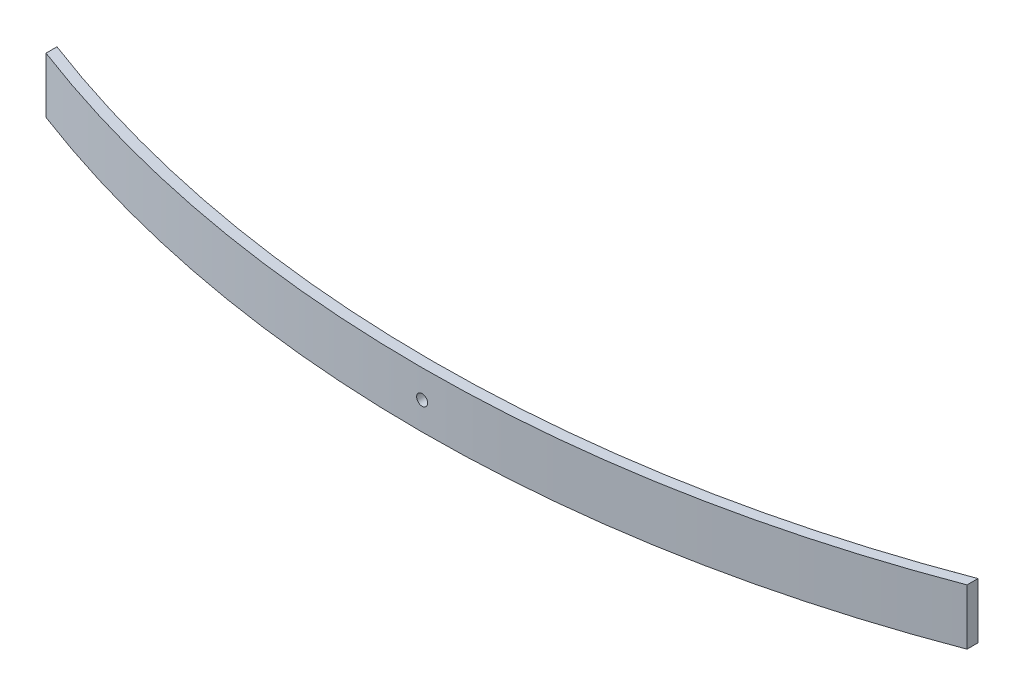
ISO-10303-21;
HEADER;
FILE_DESCRIPTION(('STEP AP214'),'2;1');
FILE_NAME('part.step','',(''),(''),'','','');
FILE_SCHEMA(('AUTOMOTIVE_DESIGN { 1 0 10303 214 1 1 1 1 }'));
ENDSEC;
DATA;
#1=APPLICATION_CONTEXT('core data for automotive mechanical design processes');
#2=APPLICATION_PROTOCOL_DEFINITION('international standard','automotive_design',2000,#1);
#3=PRODUCT_CONTEXT('',#1,'mechanical');
#4=PRODUCT('Part','Part','',(#3));
#5=PRODUCT_RELATED_PRODUCT_CATEGORY('part','',(#4));
#6=PRODUCT_DEFINITION_FORMATION('','',#4);
#7=PRODUCT_DEFINITION_CONTEXT('part definition',#1,'design');
#8=PRODUCT_DEFINITION('design','',#6,#7);
#9=PRODUCT_DEFINITION_SHAPE('','',#8);
#10=(LENGTH_UNIT() NAMED_UNIT(*) SI_UNIT(.MILLI.,.METRE.));
#11=(NAMED_UNIT(*) PLANE_ANGLE_UNIT() SI_UNIT($,.RADIAN.));
#12=(NAMED_UNIT(*) SI_UNIT($,.STERADIAN.) SOLID_ANGLE_UNIT());
#13=UNCERTAINTY_MEASURE_WITH_UNIT(LENGTH_MEASURE(1.E-05),#10,'distance_accuracy_value','');
#14=(GEOMETRIC_REPRESENTATION_CONTEXT(3) GLOBAL_UNCERTAINTY_ASSIGNED_CONTEXT((#13)) GLOBAL_UNIT_ASSIGNED_CONTEXT((#10,
#11,#12)) REPRESENTATION_CONTEXT('',''));
#15=CARTESIAN_POINT('',(0.,0.,0.));
#16=DIRECTION('',(0.,0.,1.));
#17=DIRECTION('',(1.,0.,0.));
#18=AXIS2_PLACEMENT_3D('',#15,#16,#17);
#19=CARTESIAN_POINT('',(3.41240888505662E-13,76.2,-1598.04997748712));
#20=DIRECTION('',(0.,-1.,0.));
#21=DIRECTION('',(0.,0.,-1.));
#22=AXIS2_PLACEMENT_3D('',#19,#20,#21);
#23=CYLINDRICAL_SURFACE('',#22,1776.04997748712);
#24=CARTESIAN_POINT('',(3.41240888505662E-13,0.,-1598.04997748712));
#25=DIRECTION('',(0.,1.,0.));
#26=DIRECTION('',(0.,0.,1.));
#27=AXIS2_PLACEMENT_3D('',#24,#25,#26);
#28=CIRCLE('',#27,1776.04997748712);
#29=CARTESIAN_POINT('',(-630.021699517165,0.,62.4999858291009));
#30=VERTEX_POINT('',#29);
#31=CARTESIAN_POINT('',(630.021699517167,0.,62.4999858291006));
#32=VERTEX_POINT('',#31);
#33=EDGE_CURVE('E110',#30,#32,#28,.T.);
#34=ORIENTED_EDGE('',*,*,#33,.T.);
#35=DIRECTION('',(0.,-1.,0.));
#36=VECTOR('',#35,1.);
#37=CARTESIAN_POINT('',(630.021699517167,76.2,62.4999858291006));
#38=LINE('',#37,#36);
#39=CARTESIAN_POINT('',(630.021699517167,76.2,62.4999858291006));
#40=VERTEX_POINT('',#39);
#41=EDGE_CURVE('E64',#40,#32,#38,.T.);
#42=ORIENTED_EDGE('',*,*,#41,.F.);
#43=CARTESIAN_POINT('',(3.41240888505662E-13,76.2,-1598.04997748712));
#44=DIRECTION('',(0.,1.,0.));
#45=DIRECTION('',(0.,0.,1.));
#46=AXIS2_PLACEMENT_3D('',#43,#44,#45);
#47=CIRCLE('',#46,1776.04997748712);
#48=CARTESIAN_POINT('',(-630.021699517165,76.2,62.4999858291009));
#49=VERTEX_POINT('',#48);
#50=EDGE_CURVE('E97',#49,#40,#47,.T.);
#51=ORIENTED_EDGE('',*,*,#50,.F.);
#52=DIRECTION('',(0.,-1.,0.));
#53=VECTOR('',#52,1.);
#54=CARTESIAN_POINT('',(-630.021699517165,76.2,62.4999858291009));
#55=LINE('',#54,#53);
#56=EDGE_CURVE('E11',#49,#30,#55,.T.);
#57=ORIENTED_EDGE('',*,*,#56,.T.);
#58=EDGE_LOOP('',(#34,#42,#51,#57));
#59=FACE_BOUND('',#58,.T.);
#60=CARTESIAN_POINT('',(3.41240888505662E-13,30.6,178.));
#61=CARTESIAN_POINT('',(0.21071396809526,30.5999984867718,178.000000017793));
#62=CARTESIAN_POINT('',(0.421403110931339,30.6088837241473,177.999962421728));
#63=CARTESIAN_POINT('',(0.841354181846103,30.6443626478279,177.999813125687));
#64=CARTESIAN_POINT('',(1.05061571988474,30.6709609920998,177.999701406219));
#65=CARTESIAN_POINT('',(1.46633777348753,30.7417152082759,177.999406859924));
#66=CARTESIAN_POINT('',(1.6727956251242,30.7858867143384,177.999223969782));
#67=CARTESIAN_POINT('',(2.0813298290623,30.8914915499318,177.998792209094));
#68=CARTESIAN_POINT('',(2.28340455125452,30.9529311869034,177.99854331444));
#69=CARTESIAN_POINT('',(2.68152110119598,31.092581422703,177.997986836868));
#70=CARTESIAN_POINT('',(2.87756687230464,31.1707807807118,177.997679293301));
#71=CARTESIAN_POINT('',(3.26237590887595,31.3434199132984,177.997014137911));
#72=CARTESIAN_POINT('',(3.45113906456178,31.437859932568,177.996656525334));
#73=CARTESIAN_POINT('',(3.81998780496062,31.6422805388221,177.995901490769));
#74=CARTESIAN_POINT('',(4.00007570143562,31.7522569546409,177.995504079474));
#75=CARTESIAN_POINT('',(4.35035222525682,31.9869905222914,177.994680636078));
#76=CARTESIAN_POINT('',(4.52054062300191,32.1117480167402,177.994254603313));
#77=CARTESIAN_POINT('',(4.8497917020676,32.3751451316172,177.993386048449));
#78=CARTESIAN_POINT('',(5.00885520931145,32.5137837196368,177.992943527578));
#79=CARTESIAN_POINT('',(5.31479308067862,32.8040158599577,177.992054369382));
#80=CARTESIAN_POINT('',(5.46166320475973,32.9556138817974,177.991607730686));
#81=CARTESIAN_POINT('',(5.74206362701673,33.2705952098571,177.990723311728));
#82=CARTESIAN_POINT('',(5.87559815641402,33.4339747494305,177.990285528692));
#83=CARTESIAN_POINT('',(6.12847828337077,33.7714630692394,177.989430939818));
#84=CARTESIAN_POINT('',(6.24781862373949,33.9455757887637,177.989014141786));
#85=CARTESIAN_POINT('',(6.47138111476877,34.3032005309577,177.988213616074));
#86=CARTESIAN_POINT('',(6.57560639321574,34.4867105983523,177.987829881559));
#87=CARTESIAN_POINT('',(6.76822875919993,34.8618615632212,177.987106273531));
#88=CARTESIAN_POINT('',(6.85662560065967,35.0535025870465,177.986766400699));
#89=CARTESIAN_POINT('',(7.01695887812301,35.4435460971785,177.986140178145));
#90=CARTESIAN_POINT('',(7.08889566823651,35.6419484379214,177.98585382727));
#91=CARTESIAN_POINT('',(7.21580133308627,36.0441127387924,177.985342762279));
#92=CARTESIAN_POINT('',(7.27076981084074,36.2478748241932,177.985118049605));
#93=CARTESIAN_POINT('',(7.36333699178487,36.6592665254975,177.984736685149));
#94=CARTESIAN_POINT('',(7.40093897454993,36.8668954034658,177.984580020515));
#95=CARTESIAN_POINT('',(7.45853120590777,37.2846549482949,177.984339094535));
#96=CARTESIAN_POINT('',(7.47851535225075,37.4947864564648,177.984254858275));
#97=CARTESIAN_POINT('',(7.50070359679292,37.9159102543577,177.984161289859));
#98=CARTESIAN_POINT('',(7.50291408330494,38.1269022075309,177.98415193079));
#99=CARTESIAN_POINT('',(7.48955360463753,38.5484004665787,177.984208322118));
#100=CARTESIAN_POINT('',(7.47397607404439,38.7589065643849,177.984274100248));
#101=CARTESIAN_POINT('',(7.42514452560683,39.1778160268169,177.984478922777));
#102=CARTESIAN_POINT('',(7.3918940142833,39.3862198002124,177.984617952642));
#103=CARTESIAN_POINT('',(7.30795445093876,39.7994886750949,177.984965325868));
#104=CARTESIAN_POINT('',(7.25726512758615,40.0043537214705,177.985173670308));
#105=CARTESIAN_POINT('',(7.13880941808637,40.4090816554477,177.985653753507));
#106=CARTESIAN_POINT('',(7.07104334628307,40.6089446350516,177.9859254911));
#107=CARTESIAN_POINT('',(6.91891409978075,41.0022558470407,177.986524655178));
#108=CARTESIAN_POINT('',(6.83455053674607,41.1957039292112,177.986852082966));
#109=CARTESIAN_POINT('',(6.64984230973365,41.5747716673126,177.987553267696));
#110=CARTESIAN_POINT('',(6.54950055498232,41.7603927405782,177.9879270162));
#111=CARTESIAN_POINT('',(6.33350673998407,42.1225834438664,177.988710406047));
#112=CARTESIAN_POINT('',(6.21784939085622,42.2991499177429,177.989120059772));
#113=CARTESIAN_POINT('',(5.9720949473394,42.6418601532711,177.98996341449));
#114=CARTESIAN_POINT('',(5.84200303653178,42.8080076231488,177.990397106822));
#115=CARTESIAN_POINT('',(5.56830511634695,43.128771512429,177.99127634415));
#116=CARTESIAN_POINT('',(5.42469413510115,43.2833836517501,177.991721893463));
#117=CARTESIAN_POINT('',(4.97502421482155,43.7281685004766,177.993057195178));
#118=CARTESIAN_POINT('',(4.64986305950452,43.9996590137959,177.993946551662));
#119=CARTESIAN_POINT('',(4.13197567971187,44.3627081259291,177.995201923407));
#120=CARTESIAN_POINT('',(3.9542377070207,44.4764002086076,177.99560743072));
#121=CARTESIAN_POINT('',(3.58980904910915,44.6884506790734,177.996381434127));
#122=CARTESIAN_POINT('',(3.40311815449467,44.7868087079936,177.996749929354));
#123=CARTESIAN_POINT('',(2.83165300721054,45.0576661242206,177.99778332722));
#124=CARTESIAN_POINT('',(2.43517114126691,45.2061693090258,177.998376934446));
#125=CARTESIAN_POINT('',(1.62308827124514,45.4344169166341,177.999304792558));
#126=CARTESIAN_POINT('',(1.20748726904213,45.5141613461807,177.999639043471));
#127=CARTESIAN_POINT('',(0.368800144782799,45.6027859953174,178.000011208188));
#128=CARTESIAN_POINT('',(-0.054285919418358,45.6116667624026,178.000049124283));
#129=CARTESIAN_POINT('',(-0.896132618131742,45.5581931101371,177.999823726226));
#130=CARTESIAN_POINT('',(-1.31489325255214,45.495838689274,177.999560412068));
#131=CARTESIAN_POINT('',(-1.9303436787744,45.3504066256678,177.998962948761));
#132=CARTESIAN_POINT('',(-2.13346696571829,45.2932419084601,177.998729895662));
#133=CARTESIAN_POINT('',(-2.53416331768226,45.1620457959658,177.998203357605));
#134=CARTESIAN_POINT('',(-2.73173651249271,45.0880147954713,177.997909874061));
#135=CARTESIAN_POINT('',(-3.31406084676378,44.8412313409879,177.996950242197));
#136=CARTESIAN_POINT('',(-3.68878109502393,44.6437020734125,177.996204537467));
#137=CARTESIAN_POINT('',(-4.22148178855435,44.3027303934527,177.994991984489));
#138=CARTESIAN_POINT('',(-4.3942373213924,44.1815494254648,177.99457188216));
#139=CARTESIAN_POINT('',(-4.72893486876302,43.9250760102935,177.993712173886));
#140=CARTESIAN_POINT('',(-4.89088085068131,43.7897887877029,177.993272575197));
#141=CARTESIAN_POINT('',(-5.20283897410525,43.5060131269221,177.992386135608));
#142=CARTESIAN_POINT('',(-5.35284682055971,43.3575199778817,177.991939292171));
#143=CARTESIAN_POINT('',(-5.63977310900439,43.048473707059,177.99105133538));
#144=CARTESIAN_POINT('',(-5.77669606337042,42.8879247771157,177.990610220097));
#145=CARTESIAN_POINT('',(-6.03655633591716,42.5558335361277,177.989746002998));
#146=CARTESIAN_POINT('',(-6.15949097179796,42.3842891264941,177.989322904648));
#147=CARTESIAN_POINT('',(-6.39046942201571,42.0314575902555,177.98850682996));
#148=CARTESIAN_POINT('',(-6.49851358458296,41.8501706916273,177.988113852918));
#149=CARTESIAN_POINT('',(-6.69894774113236,41.4791360457964,177.987369158747));
#150=CARTESIAN_POINT('',(-6.79133744698087,41.2893881429429,177.987017442377));
#151=CARTESIAN_POINT('',(-6.95980221242478,40.902786593122,177.986365267457));
#152=CARTESIAN_POINT('',(-7.03587752593906,40.7059330568032,177.986064808109));
#153=CARTESIAN_POINT('',(-7.17118720449939,40.306479201795,177.985523618733));
#154=CARTESIAN_POINT('',(-7.23041839084996,40.1038778063364,177.985282899979));
#155=CARTESIAN_POINT('',(-7.33158072491758,39.6944803968447,177.98486817799));
#156=CARTESIAN_POINT('',(-7.37351824975534,39.4876859585829,177.984694150165));
#157=CARTESIAN_POINT('',(-7.43983858987247,39.0712246263154,177.984417572838));
#158=CARTESIAN_POINT('',(-7.46421508897789,38.8615567264136,177.984315049055));
#159=CARTESIAN_POINT('',(-7.49521005598162,38.4409854893936,177.984184515178));
#160=CARTESIAN_POINT('',(-7.5018346673931,38.2300826050049,177.984156479306));
#161=CARTESIAN_POINT('',(-7.49729604901424,37.8084313167283,177.984175644233));
#162=CARTESIAN_POINT('',(-7.4861297038517,37.5976829463629,177.984222858209));
#163=CARTESIAN_POINT('',(-7.44608319144536,37.1778810074955,177.984391205324));
#164=CARTESIAN_POINT('',(-7.41720343879277,36.9688273994429,177.984512336734));
#165=CARTESIAN_POINT('',(-7.34193498439903,36.5538917028769,177.984825082016));
#166=CARTESIAN_POINT('',(-7.29554590651502,36.3480096825958,177.985016697403));
#167=CARTESIAN_POINT('',(-7.18558954382411,35.9408886735011,177.985464967259));
#168=CARTESIAN_POINT('',(-7.12202252604774,35.7396496125656,177.985721620717));
#169=CARTESIAN_POINT('',(-6.9781466731971,35.3431999543684,177.986292743016));
#170=CARTESIAN_POINT('',(-6.89783430858521,35.1479906380149,177.986607224045));
#171=CARTESIAN_POINT('',(-6.72107980430736,34.7651040508113,177.987284909401));
#172=CARTESIAN_POINT('',(-6.62464362886622,34.5774240265763,177.987648095704));
#173=CARTESIAN_POINT('',(-6.41627290528473,34.2107950839362,177.988413096412));
#174=CARTESIAN_POINT('',(-6.30433343128857,34.031848965087,177.988814923083));
#175=CARTESIAN_POINT('',(-6.06581689289881,33.6840847361213,177.989645553125));
#176=CARTESIAN_POINT('',(-5.93924490882233,33.5152631415662,177.990074347111));
#177=CARTESIAN_POINT('',(-5.67231991868868,33.1888660580889,177.990946907972));
#178=CARTESIAN_POINT('',(-5.53196570521858,33.0312915565774,177.991390676157));
#179=CARTESIAN_POINT('',(-5.23848659589169,32.7285285010303,177.992280544971));
#180=CARTESIAN_POINT('',(-5.0853619960531,32.5833396600524,177.992726645546));
#181=CARTESIAN_POINT('',(-4.76738488124436,32.3063385507565,177.993608647806));
#182=CARTESIAN_POINT('',(-4.60252923302655,32.1745298791334,177.994044546725));
#183=CARTESIAN_POINT('',(-4.26230143452198,31.9252727160432,177.994893638276));
#184=CARTESIAN_POINT('',(-4.08692944268858,31.8078240082906,177.995306831249));
#185=CARTESIAN_POINT('',(-3.72679224644562,31.5880456665326,177.996099052417));
#186=CARTESIAN_POINT('',(-3.54202080718387,31.4857262485997,177.996478057458));
#187=CARTESIAN_POINT('',(-3.16457932589461,31.2970641063268,177.997190684133));
#188=CARTESIAN_POINT('',(-2.97191219636391,31.2107155544444,177.997524322307));
#189=CARTESIAN_POINT('',(-2.58015719959519,31.0546324777025,177.998136625653));
#190=CARTESIAN_POINT('',(-2.38107520557301,30.9848832197949,177.998415339535));
#191=CARTESIAN_POINT('',(-1.9778114443012,30.8624129523237,177.998910200255));
#192=CARTESIAN_POINT('',(-1.77363103212865,30.8096874689384,177.999126363529));
#193=CARTESIAN_POINT('',(-1.31020489978994,30.710643027446,177.999535351372));
#194=CARTESIAN_POINT('',(-1.04990557260723,30.6691871109606,177.99970896714));
#195=CARTESIAN_POINT('',(-0.526391255000018,30.6138665423076,177.999941280342));
#196=CARTESIAN_POINT('',(-0.263176264592139,30.6000018899826,177.999999977777));
#197=CARTESIAN_POINT('',(3.41240888505662E-13,30.6,178.));
#198=B_SPLINE_CURVE_WITH_KNOTS('',3,(#60,#61,#62,#63,#64,#65,#66,#67,#68,#69,#70,#71,#72,#73,
#74,#75,#76,#77,#78,#79,#80,#81,#82,#83,#84,#85,#86,#87,#88,#89,#90,#91,#92,#93,#94,#95,#96,#97,
#98,#99,#100,#101,#102,#103,#104,#105,#106,#107,#108,#109,#110,#111,#112,#113,#114,#115,#116,
#117,#118,#119,#120,#121,#122,#123,#124,#125,#126,#127,#128,#129,#130,#131,#132,#133,#134,#135,
#136,#137,#138,#139,#140,#141,#142,#143,#144,#145,#146,#147,#148,#149,#150,#151,#152,#153,#154,
#155,#156,#157,#158,#159,#160,#161,#162,#163,#164,#165,#166,#167,#168,#169,#170,#171,#172,#173,
#174,#175,#176,#177,#178,#179,#180,#181,#182,#183,#184,#185,#186,#187,#188,#189,#190,#191,#192,
#193,#194,#195,#196,#197),.UNSPECIFIED.,.T.,.F.,(4,2,2,2,2,2,2,2,2,2,2,2,2,2,2,2,2,2,2,2,2,2,2,
2,2,2,2,2,2,2,2,2,2,2,2,2,2,2,2,2,2,2,2,2,2,2,2,2,2,2,2,2,2,2,2,2,2,2,2,2,2,2,2,2,2,2,2,2,4),
(0.,0.631912024301778,1.2639902864152,1.89663214600144,2.52950538839113,3.16195548087539,
3.79441510307563,4.4267052459563,5.05901004782971,5.69126785680884,6.3237446098031,
6.95602004377836,7.58852893310258,8.2209067489129,8.85329439515874,9.48566843538515,
10.1180572691842,10.7503266306474,11.3828149038618,12.0150758342728,12.6475702025455,
13.2799391235442,13.9123178840565,14.5446850047721,15.177066922899,15.8093338315781,
16.4418196509556,17.0740790696136,17.7065719276866,18.9702098092056,19.602583667419,
20.2349723230349,21.4986105469059,22.7622486468442,24.0258769838608,25.2895053477042,
25.9218869189979,26.5542536895501,27.8178774792359,28.450372115571,29.0826333187677,
29.7151209754032,30.3473897231102,30.9797795065627,31.6121544983652,32.2445411283047,
32.8769179149983,33.509413959954,34.1416765599364,34.7741664524213,35.4064374266601,
36.0388191299599,36.6711860326124,37.3035665208155,37.9359371792494,38.5684412619989,
39.2007118959496,39.8331838838019,40.4654369370645,41.097745429307,41.7300392686788,
42.3625026260201,42.9949564562123,43.6278354202829,44.2604829982539,44.892566944869,
45.5244846453389,46.3137263294984,47.1029680091572),.UNSPECIFIED.);
#199=CARTESIAN_POINT('',(3.41240888505662E-13,30.6,178.));
#200=VERTEX_POINT('',#199);
#201=EDGE_CURVE('E122',#200,#200,#198,.T.);
#202=ORIENTED_EDGE('',*,*,#201,.F.);
#203=EDGE_LOOP('',(#202));
#204=FACE_BOUND('',#203,.T.);
#205=ADVANCED_FACE('F49',(#59,#204),#23,.T.);
#206=CARTESIAN_POINT('',(0.,76.2,-1613.04997748712));
#207=DIRECTION('',(0.,-1.,0.));
#208=DIRECTION('',(0.,0.,-1.));
#209=AXIS2_PLACEMENT_3D('',#206,#207,#208);
#210=CYLINDRICAL_SURFACE('',#209,1776.04997748712);
#211=CARTESIAN_POINT('',(0.,0.,-1613.04997748712));
#212=DIRECTION('',(0.,1.,0.));
#213=DIRECTION('',(0.,0.,1.));
#214=AXIS2_PLACEMENT_3D('',#211,#212,#213);
#215=CIRCLE('',#214,1776.04997748712);
#216=CARTESIAN_POINT('',(-630.021699517165,0.,47.4999858291007));
#217=VERTEX_POINT('',#216);
#218=CARTESIAN_POINT('',(630.021699517166,0.,47.4999858291007));
#219=VERTEX_POINT('',#218);
#220=EDGE_CURVE('E126',#217,#219,#215,.T.);
#221=ORIENTED_EDGE('',*,*,#220,.F.);
#222=DIRECTION('',(0.,-1.,0.));
#223=VECTOR('',#222,1.);
#224=CARTESIAN_POINT('',(-630.021699517165,76.2,47.4999858291007));
#225=LINE('',#224,#223);
#226=CARTESIAN_POINT('',(-630.021699517165,76.2,47.4999858291007));
#227=VERTEX_POINT('',#226);
#228=EDGE_CURVE('E72',#227,#217,#225,.T.);
#229=ORIENTED_EDGE('',*,*,#228,.F.);
#230=CARTESIAN_POINT('',(0.,76.2,-1613.04997748712));
#231=DIRECTION('',(0.,1.,0.));
#232=DIRECTION('',(0.,0.,1.));
#233=AXIS2_PLACEMENT_3D('',#230,#231,#232);
#234=CIRCLE('',#233,1776.04997748712);
#235=CARTESIAN_POINT('',(630.021699517166,76.2,47.4999858291007));
#236=VERTEX_POINT('',#235);
#237=EDGE_CURVE('E115',#227,#236,#234,.T.);
#238=ORIENTED_EDGE('',*,*,#237,.T.);
#239=DIRECTION('',(0.,-1.,0.));
#240=VECTOR('',#239,1.);
#241=CARTESIAN_POINT('',(630.021699517166,76.2,47.4999858291007));
#242=LINE('',#241,#240);
#243=EDGE_CURVE('E86',#236,#219,#242,.T.);
#244=ORIENTED_EDGE('',*,*,#243,.T.);
#245=EDGE_LOOP('',(#221,#229,#238,#244));
#246=FACE_BOUND('',#245,.T.);
#247=CARTESIAN_POINT('',(-7.5,38.1,162.984164226377));
#248=CARTESIAN_POINT('',(-7.50000151322819,37.8892860319145,162.984164208571));
#249=CARTESIAN_POINT('',(-7.49111627585349,37.6785968890879,162.984201804954));
#250=CARTESIAN_POINT('',(-7.45563735217615,37.2586458181922,162.984351102375));
#251=CARTESIAN_POINT('',(-7.42903900790671,37.0493842801633,162.984462822905));
#252=CARTESIAN_POINT('',(-7.35828479173724,36.63366222658,162.984757371678));
#253=CARTESIAN_POINT('',(-7.31411328567894,36.4272043749532,162.984940263235));
#254=CARTESIAN_POINT('',(-7.208508450096,36.018670171035,162.985372027225));
#255=CARTESIAN_POINT('',(-7.14706881313062,35.8165954488529,162.985620923766));
#256=CARTESIAN_POINT('',(-7.00741857734594,35.418478898933,162.98617740523));
#257=CARTESIAN_POINT('',(-6.92921921934607,35.2224331278356,162.986484950802));
#258=CARTESIAN_POINT('',(-6.75658008677935,34.837624091286,162.987150110131));
#259=CARTESIAN_POINT('',(-6.66214006752074,34.6488609356104,162.987507724643));
#260=CARTESIAN_POINT('',(-6.45771946129041,34.2800121952304,162.988262762776));
#261=CARTESIAN_POINT('',(-6.34774304548433,34.0999242987638,162.988660175705));
#262=CARTESIAN_POINT('',(-6.11300947786033,33.7496477749571,162.989483621892));
#263=CARTESIAN_POINT('',(-5.98825198342546,33.5794593772181,162.989909655814));
#264=CARTESIAN_POINT('',(-5.72485486856214,33.2502082981437,162.990778212374));
#265=CARTESIAN_POINT('',(-5.58621628054089,33.0911447908863,162.991220733785));
#266=CARTESIAN_POINT('',(-5.29598414021393,32.7852069194919,162.992109892413));
#267=CARTESIAN_POINT('',(-5.14438611836974,32.6383367953972,162.992556531002));
#268=CARTESIAN_POINT('',(-4.82940479029845,32.3579363731136,162.993440949047));
#269=CARTESIAN_POINT('',(-4.66602525071788,32.2244018437033,162.993878731277));
#270=CARTESIAN_POINT('',(-4.32853693089197,31.9715217167215,162.994733317997));
#271=CARTESIAN_POINT('',(-4.15442421135789,31.8521813763408,162.99515011468));
#272=CARTESIAN_POINT('',(-3.79679946915635,31.6286188852982,162.995950637268));
#273=CARTESIAN_POINT('',(-3.61328940176486,31.5243936068487,162.996334370008));
#274=CARTESIAN_POINT('',(-3.23813843690194,31.331771240859,162.997057974284));
#275=CARTESIAN_POINT('',(-3.04649741307954,31.2433743993964,162.997397845139));
#276=CARTESIAN_POINT('',(-2.65645390295346,31.083041121927,162.998024063724));
#277=CARTESIAN_POINT('',(-2.4580515622135,31.0111043318103,162.998310412606));
#278=CARTESIAN_POINT('',(-2.05588726134914,30.8841986669541,162.998821473857));
#279=CARTESIAN_POINT('',(-1.85212517595196,30.8292301891963,162.999046184785));
#280=CARTESIAN_POINT('',(-1.44073347465677,30.7366630082454,162.999427546169));
#281=CARTESIAN_POINT('',(-1.23310459669404,30.6990610254769,162.999584209475));
#282=CARTESIAN_POINT('',(-0.815345051876459,30.6414687941111,162.999825133398));
#283=CARTESIAN_POINT('',(-0.605213543712588,30.6214846477638,162.999909368927));
#284=CARTESIAN_POINT('',(-0.184089745831484,30.5992964032119,163.000002936514));
#285=CARTESIAN_POINT('',(0.0269022073360933,30.5970859166945,163.000012295484));
#286=CARTESIAN_POINT('',(0.448400466373139,30.6104463953503,162.999955904647));
#287=CARTESIAN_POINT('',(0.658906564174368,30.6260239259372,162.999890127108));
#288=CARTESIAN_POINT('',(1.07781602663256,30.6748554743656,162.999685306357));
#289=CARTESIAN_POINT('',(1.28621980005893,30.7081059856891,162.999546277678));
#290=CARTESIAN_POINT('',(1.69948867500321,30.792045549039,162.999198907313));
#291=CARTESIAN_POINT('',(1.90435372140974,30.842734872397,162.998990564549));
#292=CARTESIAN_POINT('',(2.30908165544806,30.9611905819128,162.998510484954));
#293=CARTESIAN_POINT('',(2.50894463508202,31.0289566537268,162.998238749291));
#294=CARTESIAN_POINT('',(2.90225584712975,31.1810859002556,162.997639589155));
#295=CARTESIAN_POINT('',(3.09570392932878,31.2654494633062,162.997312163378));
#296=CARTESIAN_POINT('',(3.47477166746599,31.4501576903461,162.996610982501));
#297=CARTESIAN_POINT('',(3.6603927407395,31.5504994451075,162.996237235837));
#298=CARTESIAN_POINT('',(4.02258344404181,31.766493260127,162.995453849319));
#299=CARTESIAN_POINT('',(4.1991499179246,31.8821506092661,162.995044197084));
#300=CARTESIAN_POINT('',(4.54186015346291,32.1279050528061,162.994200844778));
#301=CARTESIAN_POINT('',(4.70800762334451,32.2579969636256,162.993767153369));
#302=CARTESIAN_POINT('',(5.02877151263007,32.5316948838342,162.992887917265));
#303=CARTESIAN_POINT('',(5.18338365195258,32.675305865092,162.992442368252));
#304=CARTESIAN_POINT('',(5.62816850065028,33.124975785377,162.991107066408));
#305=CARTESIAN_POINT('',(5.89965901394052,33.4501369406816,162.990217708469));
#306=CARTESIAN_POINT('',(6.26270812603403,33.968024320448,162.988962332907));
#307=CARTESIAN_POINT('',(6.37640020870003,34.1457622931292,162.988556824049));
#308=CARTESIAN_POINT('',(6.58845067914274,34.510190951019,162.987782817221));
#309=CARTESIAN_POINT('',(6.68680870805227,34.6968818456216,162.987414320118));
#310=CARTESIAN_POINT('',(6.95766612427186,35.2683469929126,162.986380916429));
#311=CARTESIAN_POINT('',(7.10616930907641,35.6648288588769,162.985787305057));
#312=CARTESIAN_POINT('',(7.33441691667697,36.4769117289435,162.98485943989));
#313=CARTESIAN_POINT('',(7.4141613462167,36.8925127311706,162.98452518607));
#314=CARTESIAN_POINT('',(7.50278599532745,37.7311998554401,162.98415301811));
#315=CARTESIAN_POINT('',(7.51166676240022,38.1542859196266,162.984115101681));
#316=CARTESIAN_POINT('',(7.45819311011506,38.9961326183076,162.984340501734));
#317=CARTESIAN_POINT('',(7.39583868924482,39.4148932527102,162.984603818221));
#318=CARTESIAN_POINT('',(7.25040662563846,40.0303436788814,162.985201286274));
#319=CARTESIAN_POINT('',(7.19324190843678,40.2334669657938,162.985434341165));
#320=CARTESIAN_POINT('',(7.06204579596008,40.6341633176956,162.98596088302));
#321=CARTESIAN_POINT('',(6.988014795477,40.8317365124754,162.986254368569));
#322=CARTESIAN_POINT('',(6.74123134103598,41.4140608466579,162.987214006388));
#323=CARTESIAN_POINT('',(6.54370207349932,41.7887810948626,162.987959715012));
#324=CARTESIAN_POINT('',(6.20273039359089,42.3214817883514,162.98917227251));
#325=CARTESIAN_POINT('',(6.08154942560718,42.4942373211955,162.989592376125));
#326=CARTESIAN_POINT('',(5.82507601044284,42.8289348685792,162.990452086404));
#327=CARTESIAN_POINT('',(5.68978878785504,42.9908808505045,162.990891685812));
#328=CARTESIAN_POINT('',(5.40601312707813,43.3028389739433,162.991778126146));
#329=CARTESIAN_POINT('',(5.25751997803879,43.4528468204056,162.99222496961));
#330=CARTESIAN_POINT('',(4.94847370721621,43.7397731088667,162.993112925805));
#331=CARTESIAN_POINT('',(4.78792477727201,43.8766960632411,162.993554040465));
#332=CARTESIAN_POINT('',(4.45583353628019,44.1365563358048,162.994418255711));
#333=CARTESIAN_POINT('',(4.28428912664369,44.2594909716942,162.994841352831));
#334=CARTESIAN_POINT('',(3.93145759039771,44.4904694219284,162.995657424618));
#335=CARTESIAN_POINT('',(3.75017069176505,44.5985135845037,162.996050399988));
#336=CARTESIAN_POINT('',(3.37913604592411,44.7989477410682,162.99679509052));
#337=CARTESIAN_POINT('',(3.18938814306502,44.8913374469238,162.997146804922));
#338=CARTESIAN_POINT('',(2.80278659323259,45.0598022123805,162.997798975874));
#339=CARTESIAN_POINT('',(2.60593305690778,45.1358775259005,162.998099433222));
#340=CARTESIAN_POINT('',(2.20647920190445,45.2711872044654,162.998640618766));
#341=CARTESIAN_POINT('',(2.00387780645708,45.3304183908162,162.998881335688));
#342=CARTESIAN_POINT('',(1.59448039698905,45.4315807248859,162.999296054414));
#343=CARTESIAN_POINT('',(1.38768595873948,45.4735182497255,162.99947008081));
#344=CARTESIAN_POINT('',(0.971224626496976,45.5398385898484,162.999746655793));
#345=CARTESIAN_POINT('',(0.761556726607796,45.5642150889577,162.999849178663));
#346=CARTESIAN_POINT('',(0.340985489613203,45.5952100559713,162.999979711378));
#347=CARTESIAN_POINT('',(0.130082605237178,45.6018346673887,163.000007747002));
#348=CARTESIAN_POINT('',(-0.291568683048704,45.5972960490235,162.999988582247));
#349=CARTESIAN_POINT('',(-0.502317053436061,45.5861297038658,162.99994136869));
#350=CARTESIAN_POINT('',(-0.922118992347884,45.5460831914654,162.999773023057));
#351=CARTESIAN_POINT('',(-1.13117260042308,45.5172034388139,162.99965189271));
#352=CARTESIAN_POINT('',(-1.54610829703443,45.4419349844183,162.999339150039));
#353=CARTESIAN_POINT('',(-1.75199031733827,45.3955459065315,162.9991475362));
#354=CARTESIAN_POINT('',(-2.15911132647842,45.2855895438309,162.998699269789));
#355=CARTESIAN_POINT('',(-2.36035038743662,45.2220225260477,162.998442618228));
#356=CARTESIAN_POINT('',(-2.75680004567823,45.0781466731794,162.997871499833));
#357=CARTESIAN_POINT('',(-2.95200936205342,44.9978343085567,162.997557020813));
#358=CARTESIAN_POINT('',(-3.33489594929877,44.8210798042535,162.99687933939));
#359=CARTESIAN_POINT('',(-3.52257597355381,44.7246436287978,162.996516155014));
#360=CARTESIAN_POINT('',(-3.88920491623113,44.5162729051841,162.995751157795));
#361=CARTESIAN_POINT('',(-4.06815103509761,44.4043334311702,162.995349332688));
#362=CARTESIAN_POINT('',(-4.41591526409443,44.1658168927426,162.994518705298));
#363=CARTESIAN_POINT('',(-4.58473685866347,44.0392449086459,162.994089912401));
#364=CARTESIAN_POINT('',(-4.9111339421384,43.7723199184915,162.993217353088));
#365=CARTESIAN_POINT('',(-5.0687084436356,43.631965705023,162.992773585362));
#366=CARTESIAN_POINT('',(-5.37147149915389,43.3384865957023,162.991883716795));
#367=CARTESIAN_POINT('',(-5.51666034011747,43.1853619958683,162.991437616008));
#368=CARTESIAN_POINT('',(-5.79366144938522,42.8673848810716,162.99055561267));
#369=CARTESIAN_POINT('',(-5.9254701209946,42.7025292328611,162.990119712884));
#370=CARTESIAN_POINT('',(-6.17472728405848,42.3623014343739,162.989270619054));
#371=CARTESIAN_POINT('',(-6.29217599179848,42.1869294425506,162.988857424669));
#372=CARTESIAN_POINT('',(-6.51195433354262,41.8267922463143,162.988065200254));
#373=CARTESIAN_POINT('',(-6.61427375147285,41.6420208070485,162.987686193377));
#374=CARTESIAN_POINT('',(-6.80293589374009,41.264579325751,162.986973562955));
#375=CARTESIAN_POINT('',(-6.88928444561939,41.0719121962162,162.986639922868));
#376=CARTESIAN_POINT('',(-7.04536752235469,40.6801571994393,162.986027615559));
#377=CARTESIAN_POINT('',(-7.11511678025875,40.4810752054131,162.985748899626));
#378=CARTESIAN_POINT('',(-7.23758704772251,40.0778114441325,162.985254035172));
#379=CARTESIAN_POINT('',(-7.29031253110392,39.8736310319553,162.985037870214));
#380=CARTESIAN_POINT('',(-7.38935697257925,39.410204899641,162.984628879072));
#381=CARTESIAN_POINT('',(-7.43081288905515,39.1499055724881,162.984455261811));
#382=CARTESIAN_POINT('',(-7.48613345769553,38.6263912549405,162.984222946583));
#383=CARTESIAN_POINT('',(-7.49999811001736,38.3631762645626,162.984164248616));
#384=CARTESIAN_POINT('',(-7.5,38.1,162.984164226377));
#385=B_SPLINE_CURVE_WITH_KNOTS('',3,(#247,#248,#249,#250,#251,#252,#253,#254,#255,#256,#257,
#258,#259,#260,#261,#262,#263,#264,#265,#266,#267,#268,#269,#270,#271,#272,#273,#274,#275,#276,
#277,#278,#279,#280,#281,#282,#283,#284,#285,#286,#287,#288,#289,#290,#291,#292,#293,#294,#295,
#296,#297,#298,#299,#300,#301,#302,#303,#304,#305,#306,#307,#308,#309,#310,#311,#312,#313,#314,
#315,#316,#317,#318,#319,#320,#321,#322,#323,#324,#325,#326,#327,#328,#329,#330,#331,#332,#333,
#334,#335,#336,#337,#338,#339,#340,#341,#342,#343,#344,#345,#346,#347,#348,#349,#350,#351,#352,
#353,#354,#355,#356,#357,#358,#359,#360,#361,#362,#363,#364,#365,#366,#367,#368,#369,#370,#371,
#372,#373,#374,#375,#376,#377,#378,#379,#380,#381,#382,#383,#384),.UNSPECIFIED.,.T.,.F.,(4,2,2,
2,2,2,2,2,2,2,2,2,2,2,2,2,2,2,2,2,2,2,2,2,2,2,2,2,2,2,2,2,2,2,2,2,2,2,2,2,2,2,2,2,2,2,2,2,2,2,2,
2,2,2,2,2,2,2,2,2,2,2,2,2,2,2,2,2,4),(0.,0.631912024273445,1.26399028635864,1.89663214591711,
2.52950538827904,3.16195548073079,3.79441510289857,4.42670524574721,5.05901004758862,
5.69126785660492,6.32374460963637,6.95602004364789,7.58852893300835,8.22090674880479,
8.85329439503678,9.48566843524988,10.1180572690357,10.7503266304816,11.3828149036786,
12.015075834073,12.6475702023291,13.2799391234167,13.9123178840178,14.5446850048214,
15.1770669230362,15.8093338317406,16.4418196511433,17.0740790698267,17.7065719279251,
18.9702098093707,19.6025836675478,20.2349723231275,21.4986105470723,22.7622486470823,
24.0258769840529,25.2895053478503,25.9218869190543,26.554253689517,27.8178774790259,
28.4503721153762,29.0826333185882,29.7151209752384,30.3473897229599,30.9797795064268,
31.6121544982437,32.2445411281974,32.8769179149055,33.5094139598227,34.1416765597669,
34.7741664522143,35.4064374264159,36.0388191297804,36.6711860324976,37.3035665207648,
37.9359371792628,38.5684412620756,39.2007118960894,39.8331838840045,40.4654369373298,
41.0977454295341,41.7300392688676,42.3625026261715,42.9949564563263,43.6278354204137,
44.2604829984014,44.8925669450324,45.5244846455181,46.313726329588,47.1029680091571),.UNSPECIFIED.);
#386=CARTESIAN_POINT('',(-7.5,38.1,162.984164226377));
#387=VERTEX_POINT('',#386);
#388=EDGE_CURVE('E53',#387,#387,#385,.T.);
#389=ORIENTED_EDGE('',*,*,#388,.T.);
#390=EDGE_LOOP('',(#389));
#391=FACE_BOUND('',#390,.T.);
#392=ADVANCED_FACE('F148',(#246,#391),#210,.F.);
#393=CARTESIAN_POINT('',(-630.021699517165,76.2,0.));
#394=DIRECTION('',(1.,0.,0.));
#395=DIRECTION('',(0.,0.,-1.));
#396=AXIS2_PLACEMENT_3D('',#393,#394,#395);
#397=PLANE('',#396);
#398=DIRECTION('',(0.,0.,1.));
#399=VECTOR('',#398,1.);
#400=CARTESIAN_POINT('',(-630.021699517165,0.,0.));
#401=LINE('',#400,#399);
#402=EDGE_CURVE('E120',#217,#30,#401,.T.);
#403=ORIENTED_EDGE('',*,*,#402,.T.);
#404=ORIENTED_EDGE('',*,*,#56,.F.);
#405=DIRECTION('',(0.,0.,1.));
#406=VECTOR('',#405,1.);
#407=CARTESIAN_POINT('',(-630.021699517165,76.2,0.));
#408=LINE('',#407,#406);
#409=EDGE_CURVE('E105',#227,#49,#408,.T.);
#410=ORIENTED_EDGE('',*,*,#409,.F.);
#411=ORIENTED_EDGE('',*,*,#228,.T.);
#412=EDGE_LOOP('',(#403,#404,#410,#411));
#413=FACE_BOUND('',#412,.T.);
#414=ADVANCED_FACE('F51',(#413),#397,.F.);
#415=CARTESIAN_POINT('',(630.021699517163,76.2,-3.73047784969295E-11));
#416=DIRECTION('',(1.,0.,0.));
#417=DIRECTION('',(0.,0.,-1.));
#418=AXIS2_PLACEMENT_3D('',#415,#416,#417);
#419=PLANE('',#418);
#420=DIRECTION('',(0.,0.,1.));
#421=VECTOR('',#420,1.);
#422=CARTESIAN_POINT('',(630.021699517163,0.,-3.73047784969295E-11));
#423=LINE('',#422,#421);
#424=EDGE_CURVE('E124',#219,#32,#423,.T.);
#425=ORIENTED_EDGE('',*,*,#424,.F.);
#426=ORIENTED_EDGE('',*,*,#243,.F.);
#427=DIRECTION('',(0.,0.,1.));
#428=VECTOR('',#427,1.);
#429=CARTESIAN_POINT('',(630.021699517163,76.2,-3.73047784969295E-11));
#430=LINE('',#429,#428);
#431=EDGE_CURVE('E104',#236,#40,#430,.T.);
#432=ORIENTED_EDGE('',*,*,#431,.T.);
#433=ORIENTED_EDGE('',*,*,#41,.T.);
#434=EDGE_LOOP('',(#425,#426,#432,#433));
#435=FACE_BOUND('',#434,.T.);
#436=ADVANCED_FACE('F114',(#435),#419,.T.);
#437=CARTESIAN_POINT('',(0.,76.2,0.));
#438=DIRECTION('',(0.,1.,0.));
#439=DIRECTION('',(0.,0.,1.));
#440=AXIS2_PLACEMENT_3D('',#437,#438,#439);
#441=PLANE('',#440);
#442=ORIENTED_EDGE('',*,*,#409,.T.);
#443=ORIENTED_EDGE('',*,*,#50,.T.);
#444=ORIENTED_EDGE('',*,*,#431,.F.);
#445=ORIENTED_EDGE('',*,*,#237,.F.);
#446=EDGE_LOOP('',(#442,#443,#444,#445));
#447=FACE_BOUND('',#446,.T.);
#448=ADVANCED_FACE('F101',(#447),#441,.T.);
#449=CARTESIAN_POINT('',(0.,0.,0.));
#450=DIRECTION('',(0.,1.,0.));
#451=DIRECTION('',(0.,0.,1.));
#452=AXIS2_PLACEMENT_3D('',#449,#450,#451);
#453=PLANE('',#452);
#454=ORIENTED_EDGE('',*,*,#402,.F.);
#455=ORIENTED_EDGE('',*,*,#220,.T.);
#456=ORIENTED_EDGE('',*,*,#424,.T.);
#457=ORIENTED_EDGE('',*,*,#33,.F.);
#458=EDGE_LOOP('',(#454,#455,#456,#457));
#459=FACE_BOUND('',#458,.T.);
#460=ADVANCED_FACE('F142',(#459),#453,.F.);
#461=CARTESIAN_POINT('',(0.,38.1,178.));
#462=DIRECTION('',(0.,0.,-1.));
#463=DIRECTION('',(-1.,0.,0.));
#464=AXIS2_PLACEMENT_3D('',#461,#462,#463);
#465=CYLINDRICAL_SURFACE('',#464,7.5);
#466=ORIENTED_EDGE('',*,*,#388,.F.);
#467=EDGE_LOOP('',(#466));
#468=FACE_BOUND('',#467,.T.);
#469=ORIENTED_EDGE('',*,*,#201,.T.);
#470=EDGE_LOOP('',(#469));
#471=FACE_BOUND('',#470,.T.);
#472=ADVANCED_FACE('F138',(#468,#471),#465,.F.);
#473=CLOSED_SHELL('',(#205,#392,#414,#436,#448,#460,#472));
#474=MANIFOLD_SOLID_BREP('B2',#473);
#475=ADVANCED_BREP_SHAPE_REPRESENTATION('',(#18,#474),#14);
#476=SHAPE_DEFINITION_REPRESENTATION(#9,#475);
ENDSEC;
END-ISO-10303-21;
